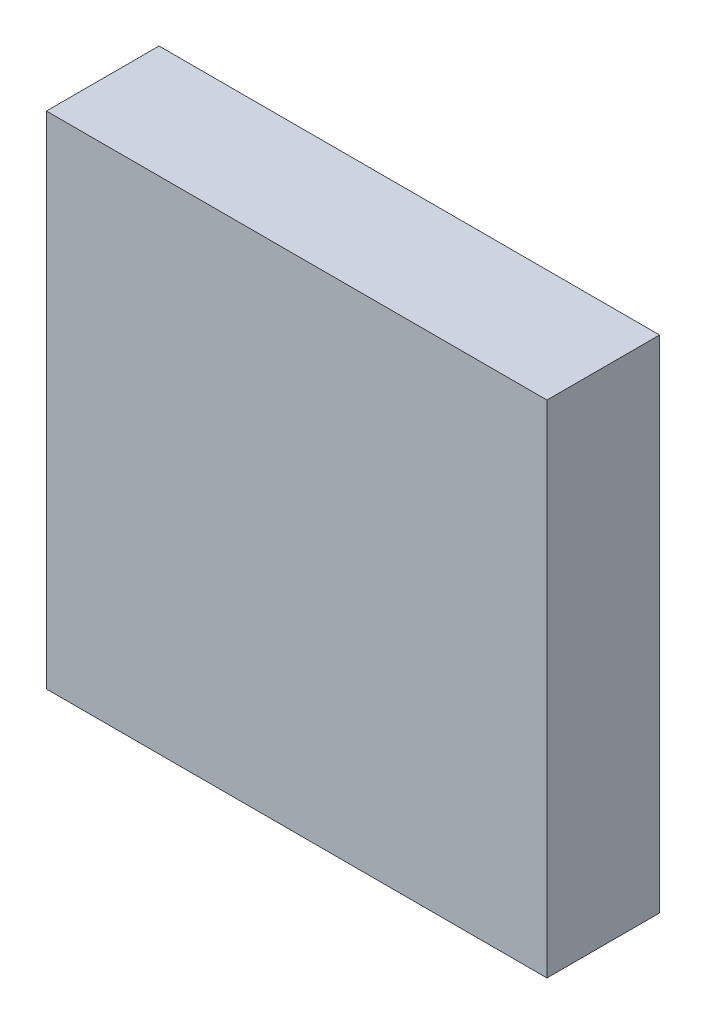
ISO-10303-21;
HEADER;
FILE_DESCRIPTION(('STEP AP214'),'2;1');
FILE_NAME('part.step','',(''),(''),'','','');
FILE_SCHEMA(('AUTOMOTIVE_DESIGN { 1 0 10303 214 1 1 1 1 }'));
ENDSEC;
DATA;
#1=APPLICATION_CONTEXT('core data for automotive mechanical design processes');
#2=APPLICATION_PROTOCOL_DEFINITION('international standard','automotive_design',2000,#1);
#3=PRODUCT_CONTEXT('',#1,'mechanical');
#4=PRODUCT('Part','Part','',(#3));
#5=PRODUCT_RELATED_PRODUCT_CATEGORY('part','',(#4));
#6=PRODUCT_DEFINITION_FORMATION('','',#4);
#7=PRODUCT_DEFINITION_CONTEXT('part definition',#1,'design');
#8=PRODUCT_DEFINITION('design','',#6,#7);
#9=PRODUCT_DEFINITION_SHAPE('','',#8);
#10=(LENGTH_UNIT() NAMED_UNIT(*) SI_UNIT(.MILLI.,.METRE.));
#11=(NAMED_UNIT(*) PLANE_ANGLE_UNIT() SI_UNIT($,.RADIAN.));
#12=(NAMED_UNIT(*) SI_UNIT($,.STERADIAN.) SOLID_ANGLE_UNIT());
#13=UNCERTAINTY_MEASURE_WITH_UNIT(LENGTH_MEASURE(1.E-05),#10,'distance_accuracy_value','');
#14=(GEOMETRIC_REPRESENTATION_CONTEXT(3) GLOBAL_UNCERTAINTY_ASSIGNED_CONTEXT((#13)) GLOBAL_UNIT_ASSIGNED_CONTEXT((#10,
#11,#12)) REPRESENTATION_CONTEXT('',''));
#15=CARTESIAN_POINT('',(0.,0.,0.));
#16=DIRECTION('',(0.,0.,1.));
#17=DIRECTION('',(1.,0.,0.));
#18=AXIS2_PLACEMENT_3D('',#15,#16,#17);
#19=CARTESIAN_POINT('',(-2.00000108,-1.99999854,0.));
#20=DIRECTION('',(-1.,0.,0.));
#21=DIRECTION('',(0.,1.,0.));
#22=AXIS2_PLACEMENT_3D('',#19,#20,#21);
#23=PLANE('',#22);
#24=DIRECTION('',(0.,0.,1.));
#25=VECTOR('',#24,1.);
#26=CARTESIAN_POINT('',(-2.00000108,-1.99999854,0.));
#27=LINE('',#26,#25);
#28=CARTESIAN_POINT('',(-2.00000108,-1.99999854,0.));
#29=VERTEX_POINT('',#28);
#30=CARTESIAN_POINT('',(-2.00000108,-1.99999854,0.90000074));
#31=VERTEX_POINT('',#30);
#32=EDGE_CURVE('E11',#29,#31,#27,.T.);
#33=ORIENTED_EDGE('',*,*,#32,.T.);
#34=DIRECTION('',(0.,1.,0.));
#35=VECTOR('',#34,1.);
#36=CARTESIAN_POINT('',(-2.00000108,-1.99999854,0.90000074));
#37=LINE('',#36,#35);
#38=CARTESIAN_POINT('',(-2.00000108,2.00000108,0.90000074));
#39=VERTEX_POINT('',#38);
#40=EDGE_CURVE('E24',#31,#39,#37,.T.);
#41=ORIENTED_EDGE('',*,*,#40,.T.);
#42=DIRECTION('',(0.,0.,1.));
#43=VECTOR('',#42,1.);
#44=CARTESIAN_POINT('',(-2.00000108,2.00000108,0.));
#45=LINE('',#44,#43);
#46=CARTESIAN_POINT('',(-2.00000108,2.00000108,0.));
#47=VERTEX_POINT('',#46);
#48=EDGE_CURVE('E85',#47,#39,#45,.T.);
#49=ORIENTED_EDGE('',*,*,#48,.F.);
#50=DIRECTION('',(0.,1.,0.));
#51=VECTOR('',#50,1.);
#52=CARTESIAN_POINT('',(-2.00000108,-1.99999854,0.));
#53=LINE('',#52,#51);
#54=EDGE_CURVE('E83',#29,#47,#53,.T.);
#55=ORIENTED_EDGE('',*,*,#54,.F.);
#56=EDGE_LOOP('',(#33,#41,#49,#55));
#57=FACE_BOUND('',#56,.T.);
#58=ADVANCED_FACE('F17',(#57),#23,.T.);
#59=CARTESIAN_POINT('',(-2.00000108,2.00000108,0.));
#60=DIRECTION('',(0.,1.,0.));
#61=DIRECTION('',(1.,0.,0.));
#62=AXIS2_PLACEMENT_3D('',#59,#60,#61);
#63=PLANE('',#62);
#64=ORIENTED_EDGE('',*,*,#48,.T.);
#65=DIRECTION('',(1.,0.,0.));
#66=VECTOR('',#65,1.);
#67=CARTESIAN_POINT('',(-2.00000108,2.00000108,0.90000074));
#68=LINE('',#67,#66);
#69=CARTESIAN_POINT('',(2.00000108,2.00000108,0.90000074));
#70=VERTEX_POINT('',#69);
#71=EDGE_CURVE('E81',#39,#70,#68,.T.);
#72=ORIENTED_EDGE('',*,*,#71,.T.);
#73=DIRECTION('',(0.,0.,1.));
#74=VECTOR('',#73,1.);
#75=CARTESIAN_POINT('',(2.00000108,2.00000108,0.));
#76=LINE('',#75,#74);
#77=CARTESIAN_POINT('',(2.00000108,2.00000108,0.));
#78=VERTEX_POINT('',#77);
#79=EDGE_CURVE('E79',#78,#70,#76,.T.);
#80=ORIENTED_EDGE('',*,*,#79,.F.);
#81=DIRECTION('',(1.,0.,0.));
#82=VECTOR('',#81,1.);
#83=CARTESIAN_POINT('',(-2.00000108,2.00000108,0.));
#84=LINE('',#83,#82);
#85=EDGE_CURVE('E70',#47,#78,#84,.T.);
#86=ORIENTED_EDGE('',*,*,#85,.F.);
#87=EDGE_LOOP('',(#64,#72,#80,#86));
#88=FACE_BOUND('',#87,.T.);
#89=ADVANCED_FACE('F90',(#88),#63,.T.);
#90=CARTESIAN_POINT('',(2.00000108,2.00000108,0.));
#91=DIRECTION('',(1.,0.,0.));
#92=DIRECTION('',(0.,-1.,0.));
#93=AXIS2_PLACEMENT_3D('',#90,#91,#92);
#94=PLANE('',#93);
#95=ORIENTED_EDGE('',*,*,#79,.T.);
#96=DIRECTION('',(0.,-1.,0.));
#97=VECTOR('',#96,1.);
#98=CARTESIAN_POINT('',(2.00000108,2.00000108,0.90000074));
#99=LINE('',#98,#97);
#100=CARTESIAN_POINT('',(2.00000108,-1.99999854,0.90000074));
#101=VERTEX_POINT('',#100);
#102=EDGE_CURVE('E60',#70,#101,#99,.T.);
#103=ORIENTED_EDGE('',*,*,#102,.T.);
#104=DIRECTION('',(0.,0.,1.));
#105=VECTOR('',#104,1.);
#106=CARTESIAN_POINT('',(2.00000108,-1.99999854,0.));
#107=LINE('',#106,#105);
#108=CARTESIAN_POINT('',(2.00000108,-1.99999854,0.));
#109=VERTEX_POINT('',#108);
#110=EDGE_CURVE('E54',#109,#101,#107,.T.);
#111=ORIENTED_EDGE('',*,*,#110,.F.);
#112=DIRECTION('',(0.,-1.,0.));
#113=VECTOR('',#112,1.);
#114=CARTESIAN_POINT('',(2.00000108,2.00000108,0.));
#115=LINE('',#114,#113);
#116=EDGE_CURVE('E58',#78,#109,#115,.T.);
#117=ORIENTED_EDGE('',*,*,#116,.F.);
#118=EDGE_LOOP('',(#95,#103,#111,#117));
#119=FACE_BOUND('',#118,.T.);
#120=ADVANCED_FACE('F57',(#119),#94,.T.);
#121=CARTESIAN_POINT('',(2.00000108,-1.99999854,0.));
#122=DIRECTION('',(0.,-1.,0.));
#123=DIRECTION('',(-1.,0.,0.));
#124=AXIS2_PLACEMENT_3D('',#121,#122,#123);
#125=PLANE('',#124);
#126=ORIENTED_EDGE('',*,*,#110,.T.);
#127=DIRECTION('',(-1.,0.,0.));
#128=VECTOR('',#127,1.);
#129=CARTESIAN_POINT('',(2.00000108,-1.99999854,0.90000074));
#130=LINE('',#129,#128);
#131=EDGE_CURVE('E71',#101,#31,#130,.T.);
#132=ORIENTED_EDGE('',*,*,#131,.T.);
#133=ORIENTED_EDGE('',*,*,#32,.F.);
#134=DIRECTION('',(-1.,0.,0.));
#135=VECTOR('',#134,1.);
#136=CARTESIAN_POINT('',(2.00000108,-1.99999854,0.));
#137=LINE('',#136,#135);
#138=EDGE_CURVE('E68',#109,#29,#137,.T.);
#139=ORIENTED_EDGE('',*,*,#138,.F.);
#140=EDGE_LOOP('',(#126,#132,#133,#139));
#141=FACE_BOUND('',#140,.T.);
#142=ADVANCED_FACE('F73',(#141),#125,.T.);
#143=CARTESIAN_POINT('',(0.,1.270000005664E-06,0.));
#144=DIRECTION('',(0.,0.,-1.));
#145=DIRECTION('',(-1.,0.,0.));
#146=AXIS2_PLACEMENT_3D('',#143,#144,#145);
#147=PLANE('',#146);
#148=ORIENTED_EDGE('',*,*,#54,.T.);
#149=ORIENTED_EDGE('',*,*,#85,.T.);
#150=ORIENTED_EDGE('',*,*,#116,.T.);
#151=ORIENTED_EDGE('',*,*,#138,.T.);
#152=EDGE_LOOP('',(#148,#149,#150,#151));
#153=FACE_BOUND('',#152,.T.);
#154=ADVANCED_FACE('F67',(#153),#147,.T.);
#155=CARTESIAN_POINT('',(0.,1.270000005664E-06,0.90000074));
#156=DIRECTION('',(0.,0.,-1.));
#157=DIRECTION('',(-1.,0.,0.));
#158=AXIS2_PLACEMENT_3D('',#155,#156,#157);
#159=PLANE('',#158);
#160=ORIENTED_EDGE('',*,*,#131,.F.);
#161=ORIENTED_EDGE('',*,*,#102,.F.);
#162=ORIENTED_EDGE('',*,*,#71,.F.);
#163=ORIENTED_EDGE('',*,*,#40,.F.);
#164=EDGE_LOOP('',(#160,#161,#162,#163));
#165=FACE_BOUND('',#164,.T.);
#166=ADVANCED_FACE('F91',(#165),#159,.F.);
#167=CLOSED_SHELL('',(#58,#89,#120,#142,#154,#166));
#168=MANIFOLD_SOLID_BREP('B1',#167);
#169=ADVANCED_BREP_SHAPE_REPRESENTATION('',(#18,#168),#14);
#170=SHAPE_DEFINITION_REPRESENTATION(#9,#169);
ENDSEC;
END-ISO-10303-21;
